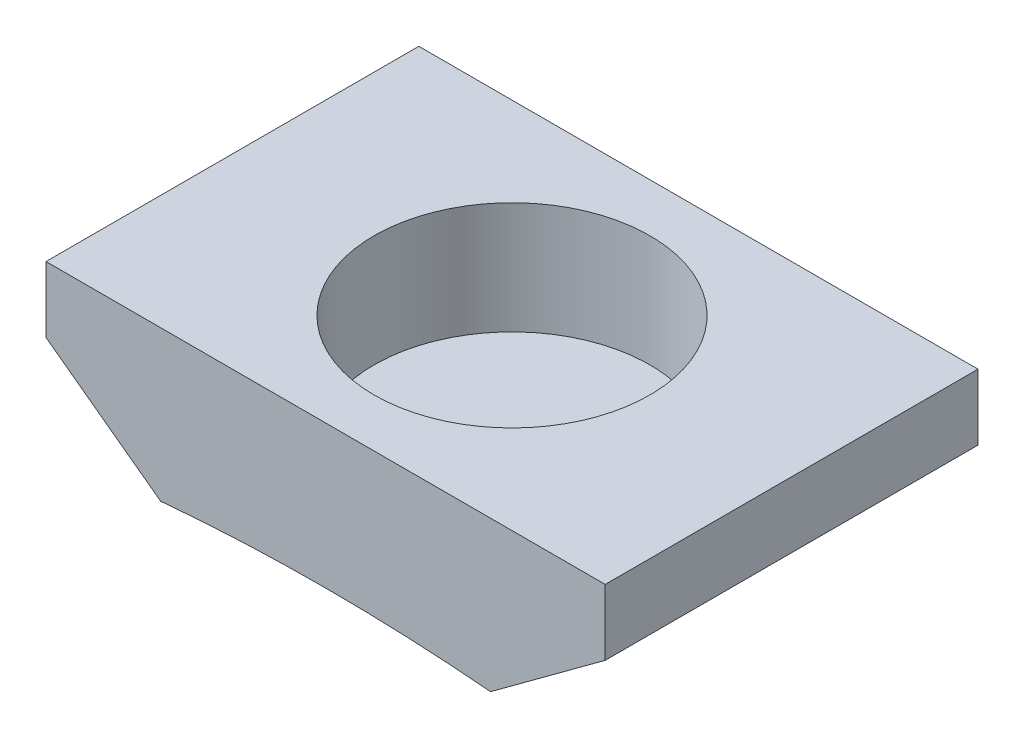
ISO-10303-21;
HEADER;
FILE_DESCRIPTION(('STEP AP214'),'2;1');
FILE_NAME('part.step','',(''),(''),'','','');
FILE_SCHEMA(('AUTOMOTIVE_DESIGN { 1 0 10303 214 1 1 1 1 }'));
ENDSEC;
DATA;
#1=APPLICATION_CONTEXT('core data for automotive mechanical design processes');
#2=APPLICATION_PROTOCOL_DEFINITION('international standard','automotive_design',2000,#1);
#3=PRODUCT_CONTEXT('',#1,'mechanical');
#4=PRODUCT('Part','Part','',(#3));
#5=PRODUCT_RELATED_PRODUCT_CATEGORY('part','',(#4));
#6=PRODUCT_DEFINITION_FORMATION('','',#4);
#7=PRODUCT_DEFINITION_CONTEXT('part definition',#1,'design');
#8=PRODUCT_DEFINITION('design','',#6,#7);
#9=PRODUCT_DEFINITION_SHAPE('','',#8);
#10=(LENGTH_UNIT() NAMED_UNIT(*) SI_UNIT(.MILLI.,.METRE.));
#11=(NAMED_UNIT(*) PLANE_ANGLE_UNIT() SI_UNIT($,.RADIAN.));
#12=(NAMED_UNIT(*) SI_UNIT($,.STERADIAN.) SOLID_ANGLE_UNIT());
#13=UNCERTAINTY_MEASURE_WITH_UNIT(LENGTH_MEASURE(1.E-05),#10,'distance_accuracy_value','');
#14=(GEOMETRIC_REPRESENTATION_CONTEXT(3) GLOBAL_UNCERTAINTY_ASSIGNED_CONTEXT((#13)) GLOBAL_UNIT_ASSIGNED_CONTEXT((#10,
#11,#12)) REPRESENTATION_CONTEXT('',''));
#15=CARTESIAN_POINT('',(0.,0.,0.));
#16=DIRECTION('',(0.,0.,1.));
#17=DIRECTION('',(1.,0.,0.));
#18=AXIS2_PLACEMENT_3D('',#15,#16,#17);
#19=CARTESIAN_POINT('',(-7.5,1.4,5.));
#20=DIRECTION('',(1.,0.,0.));
#21=DIRECTION('',(0.,0.,-1.));
#22=AXIS2_PLACEMENT_3D('',#19,#20,#21);
#23=PLANE('',#22);
#24=DIRECTION('',(0.,-1.,0.));
#25=VECTOR('',#24,1.);
#26=CARTESIAN_POINT('',(-7.5,1.4,-5.));
#27=LINE('',#26,#25);
#28=CARTESIAN_POINT('',(-7.5,4.4,-5.));
#29=VERTEX_POINT('',#28);
#30=CARTESIAN_POINT('',(-7.5,2.63461569632752,-5.));
#31=VERTEX_POINT('',#30);
#32=EDGE_CURVE('E122',#29,#31,#27,.T.);
#33=ORIENTED_EDGE('',*,*,#32,.T.);
#34=DIRECTION('',(0.,0.,1.));
#35=VECTOR('',#34,1.);
#36=CARTESIAN_POINT('',(-7.5,2.63461569632752,5.));
#37=LINE('',#36,#35);
#38=CARTESIAN_POINT('',(-7.5,2.63461569632752,5.));
#39=VERTEX_POINT('',#38);
#40=EDGE_CURVE('E11',#31,#39,#37,.T.);
#41=ORIENTED_EDGE('',*,*,#40,.T.);
#42=DIRECTION('',(0.,-1.,0.));
#43=VECTOR('',#42,1.);
#44=CARTESIAN_POINT('',(-7.5,1.4,5.));
#45=LINE('',#44,#43);
#46=CARTESIAN_POINT('',(-7.5,4.4,5.));
#47=VERTEX_POINT('',#46);
#48=EDGE_CURVE('E90',#47,#39,#45,.T.);
#49=ORIENTED_EDGE('',*,*,#48,.F.);
#50=DIRECTION('',(0.,0.,1.));
#51=VECTOR('',#50,1.);
#52=CARTESIAN_POINT('',(-7.5,4.4,5.));
#53=LINE('',#52,#51);
#54=EDGE_CURVE('E94',#29,#47,#53,.T.);
#55=ORIENTED_EDGE('',*,*,#54,.F.);
#56=EDGE_LOOP('',(#33,#41,#49,#55));
#57=FACE_BOUND('',#56,.T.);
#58=ADVANCED_FACE('F35',(#57),#23,.F.);
#59=CARTESIAN_POINT('',(7.5,1.4,5.));
#60=DIRECTION('',(0.,0.,-1.));
#61=DIRECTION('',(-1.,0.,0.));
#62=AXIS2_PLACEMENT_3D('',#59,#60,#61);
#63=PLANE('',#62);
#64=CARTESIAN_POINT('',(0.,-49.434299833213,5.));
#65=DIRECTION('',(0.,0.,-1.));
#66=DIRECTION('',(-1.,0.,0.));
#67=AXIS2_PLACEMENT_3D('',#64,#65,#66);
#68=CIRCLE('',#67,50.);
#69=CARTESIAN_POINT('',(-4.42469587988262,0.369536026794327,5.));
#70=VERTEX_POINT('',#69);
#71=CARTESIAN_POINT('',(4.42469587988261,0.369536026794334,5.));
#72=VERTEX_POINT('',#71);
#73=EDGE_CURVE('E116',#70,#72,#68,.T.);
#74=ORIENTED_EDGE('',*,*,#73,.T.);
#75=DIRECTION('',(-0.805172589883462,-0.593040555527494,0.));
#76=VECTOR('',#75,1.);
#77=CARTESIAN_POINT('',(7.5,2.63461569632752,5.));
#78=LINE('',#77,#76);
#79=CARTESIAN_POINT('',(7.5,2.63461569632752,5.));
#80=VERTEX_POINT('',#79);
#81=EDGE_CURVE('E43',#72,#80,#78,.F.);
#82=ORIENTED_EDGE('',*,*,#81,.T.);
#83=DIRECTION('',(0.,-1.,0.));
#84=VECTOR('',#83,1.);
#85=CARTESIAN_POINT('',(7.5,1.4,5.));
#86=LINE('',#85,#84);
#87=CARTESIAN_POINT('',(7.5,4.4,5.));
#88=VERTEX_POINT('',#87);
#89=EDGE_CURVE('E97',#88,#80,#86,.T.);
#90=ORIENTED_EDGE('',*,*,#89,.F.);
#91=DIRECTION('',(1.,0.,0.));
#92=VECTOR('',#91,1.);
#93=CARTESIAN_POINT('',(7.5,4.4,5.));
#94=LINE('',#93,#92);
#95=EDGE_CURVE('E100',#47,#88,#94,.T.);
#96=ORIENTED_EDGE('',*,*,#95,.F.);
#97=ORIENTED_EDGE('',*,*,#48,.T.);
#98=DIRECTION('',(0.80517258988346,-0.593040555527496,0.));
#99=VECTOR('',#98,1.);
#100=CARTESIAN_POINT('',(-7.5,2.63461569632752,5.));
#101=LINE('',#100,#99);
#102=EDGE_CURVE('E50',#39,#70,#101,.T.);
#103=ORIENTED_EDGE('',*,*,#102,.T.);
#104=EDGE_LOOP('',(#74,#82,#90,#96,#97,#103));
#105=FACE_BOUND('',#104,.T.);
#106=ADVANCED_FACE('F101',(#105),#63,.F.);
#107=CARTESIAN_POINT('',(7.5,1.4,5.));
#108=DIRECTION('',(-1.,0.,0.));
#109=DIRECTION('',(0.,0.,1.));
#110=AXIS2_PLACEMENT_3D('',#107,#108,#109);
#111=PLANE('',#110);
#112=ORIENTED_EDGE('',*,*,#89,.T.);
#113=DIRECTION('',(0.,0.,-1.));
#114=VECTOR('',#113,1.);
#115=CARTESIAN_POINT('',(7.5,2.63461569632752,5.));
#116=LINE('',#115,#114);
#117=CARTESIAN_POINT('',(7.5,2.63461569632752,-5.));
#118=VERTEX_POINT('',#117);
#119=EDGE_CURVE('E130',#80,#118,#116,.T.);
#120=ORIENTED_EDGE('',*,*,#119,.T.);
#121=DIRECTION('',(0.,-1.,0.));
#122=VECTOR('',#121,1.);
#123=CARTESIAN_POINT('',(7.5,1.4,-5.));
#124=LINE('',#123,#122);
#125=CARTESIAN_POINT('',(7.5,4.4,-5.));
#126=VERTEX_POINT('',#125);
#127=EDGE_CURVE('E124',#126,#118,#124,.T.);
#128=ORIENTED_EDGE('',*,*,#127,.F.);
#129=DIRECTION('',(0.,0.,-1.));
#130=VECTOR('',#129,1.);
#131=CARTESIAN_POINT('',(7.5,4.4,5.));
#132=LINE('',#131,#130);
#133=EDGE_CURVE('E106',#88,#126,#132,.T.);
#134=ORIENTED_EDGE('',*,*,#133,.F.);
#135=EDGE_LOOP('',(#112,#120,#128,#134));
#136=FACE_BOUND('',#135,.T.);
#137=ADVANCED_FACE('F144',(#136),#111,.F.);
#138=CARTESIAN_POINT('',(7.5,1.4,-5.));
#139=DIRECTION('',(0.,0.,1.));
#140=DIRECTION('',(1.,0.,0.));
#141=AXIS2_PLACEMENT_3D('',#138,#139,#140);
#142=PLANE('',#141);
#143=ORIENTED_EDGE('',*,*,#127,.T.);
#144=DIRECTION('',(0.805172589883462,0.593040555527494,0.));
#145=VECTOR('',#144,1.);
#146=CARTESIAN_POINT('',(7.5,2.63461569632752,-5.));
#147=LINE('',#146,#145);
#148=CARTESIAN_POINT('',(4.42469587988261,0.369536026794334,-5.));
#149=VERTEX_POINT('',#148);
#150=EDGE_CURVE('E135',#118,#149,#147,.F.);
#151=ORIENTED_EDGE('',*,*,#150,.T.);
#152=CARTESIAN_POINT('',(0.,-49.434299833213,-5.));
#153=DIRECTION('',(0.,0.,-1.));
#154=DIRECTION('',(-1.,0.,0.));
#155=AXIS2_PLACEMENT_3D('',#152,#153,#154);
#156=CIRCLE('',#155,50.);
#157=CARTESIAN_POINT('',(-4.42469587988262,0.369536026794327,-5.));
#158=VERTEX_POINT('',#157);
#159=EDGE_CURVE('E149',#158,#149,#156,.T.);
#160=ORIENTED_EDGE('',*,*,#159,.F.);
#161=DIRECTION('',(-0.80517258988346,0.593040555527496,0.));
#162=VECTOR('',#161,1.);
#163=CARTESIAN_POINT('',(-7.5,2.63461569632752,-5.));
#164=LINE('',#163,#162);
#165=EDGE_CURVE('E133',#158,#31,#164,.T.);
#166=ORIENTED_EDGE('',*,*,#165,.T.);
#167=ORIENTED_EDGE('',*,*,#32,.F.);
#168=DIRECTION('',(-1.,0.,0.));
#169=VECTOR('',#168,1.);
#170=CARTESIAN_POINT('',(7.5,4.4,-5.));
#171=LINE('',#170,#169);
#172=EDGE_CURVE('E112',#126,#29,#171,.T.);
#173=ORIENTED_EDGE('',*,*,#172,.F.);
#174=EDGE_LOOP('',(#143,#151,#160,#166,#167,#173));
#175=FACE_BOUND('',#174,.T.);
#176=ADVANCED_FACE('F148',(#175),#142,.F.);
#177=CARTESIAN_POINT('',(0.,4.4,0.));
#178=DIRECTION('',(0.,1.,0.));
#179=DIRECTION('',(0.,0.,1.));
#180=AXIS2_PLACEMENT_3D('',#177,#178,#179);
#181=PLANE('',#180);
#182=ORIENTED_EDGE('',*,*,#54,.T.);
#183=ORIENTED_EDGE('',*,*,#95,.T.);
#184=ORIENTED_EDGE('',*,*,#133,.T.);
#185=ORIENTED_EDGE('',*,*,#172,.T.);
#186=EDGE_LOOP('',(#182,#183,#184,#185));
#187=FACE_BOUND('',#186,.T.);
#188=CARTESIAN_POINT('',(0.,4.4,0.));
#189=DIRECTION('',(0.,1.,0.));
#190=DIRECTION('',(0.,0.,1.));
#191=AXIS2_PLACEMENT_3D('',#188,#189,#190);
#192=CIRCLE('',#191,3.7);
#193=CARTESIAN_POINT('',(0.,4.4,3.7));
#194=VERTEX_POINT('',#193);
#195=EDGE_CURVE('E113',#194,#194,#192,.T.);
#196=ORIENTED_EDGE('',*,*,#195,.F.);
#197=EDGE_LOOP('',(#196));
#198=FACE_BOUND('',#197,.T.);
#199=ADVANCED_FACE('F109',(#187,#198),#181,.T.);
#200=CARTESIAN_POINT('',(0.,4.4,0.));
#201=DIRECTION('',(0.,-1.,0.));
#202=DIRECTION('',(0.,0.,-1.));
#203=AXIS2_PLACEMENT_3D('',#200,#201,#202);
#204=CYLINDRICAL_SURFACE('',#203,3.7);
#205=ORIENTED_EDGE('',*,*,#195,.T.);
#206=EDGE_LOOP('',(#205));
#207=FACE_BOUND('',#206,.T.);
#208=CARTESIAN_POINT('',(0.,1.4,0.));
#209=DIRECTION('',(0.,1.,0.));
#210=DIRECTION('',(0.,0.,1.));
#211=AXIS2_PLACEMENT_3D('',#208,#209,#210);
#212=CIRCLE('',#211,3.7);
#213=CARTESIAN_POINT('',(0.,1.4,3.7));
#214=VERTEX_POINT('',#213);
#215=EDGE_CURVE('E96',#214,#214,#212,.F.);
#216=ORIENTED_EDGE('',*,*,#215,.T.);
#217=EDGE_LOOP('',(#216));
#218=FACE_BOUND('',#217,.T.);
#219=ADVANCED_FACE('F172',(#207,#218),#204,.F.);
#220=CARTESIAN_POINT('',(0.,1.4,0.));
#221=DIRECTION('',(0.,1.,0.));
#222=DIRECTION('',(0.,0.,1.));
#223=AXIS2_PLACEMENT_3D('',#220,#221,#222);
#224=PLANE('',#223);
#225=ORIENTED_EDGE('',*,*,#215,.F.);
#226=EDGE_LOOP('',(#225));
#227=FACE_BOUND('',#226,.T.);
#228=ADVANCED_FACE('F169',(#227),#224,.T.);
#229=CARTESIAN_POINT('',(0.,-49.434299833213,5.));
#230=DIRECTION('',(0.,0.,-1.));
#231=DIRECTION('',(-1.,0.,0.));
#232=AXIS2_PLACEMENT_3D('',#229,#230,#231);
#233=CYLINDRICAL_SURFACE('',#232,50.);
#234=ORIENTED_EDGE('',*,*,#159,.T.);
#235=DIRECTION('',(0.,0.,-1.));
#236=VECTOR('',#235,1.);
#237=CARTESIAN_POINT('',(4.42469587988261,0.369536026794334,5.));
#238=LINE('',#237,#236);
#239=EDGE_CURVE('E57',#149,#72,#238,.F.);
#240=ORIENTED_EDGE('',*,*,#239,.T.);
#241=ORIENTED_EDGE('',*,*,#73,.F.);
#242=DIRECTION('',(0.,0.,-1.));
#243=VECTOR('',#242,1.);
#244=CARTESIAN_POINT('',(-4.42469587988263,0.369536026794334,5.));
#245=LINE('',#244,#243);
#246=EDGE_CURVE('E137',#70,#158,#245,.T.);
#247=ORIENTED_EDGE('',*,*,#246,.T.);
#248=EDGE_LOOP('',(#234,#240,#241,#247));
#249=FACE_BOUND('',#248,.T.);
#250=ADVANCED_FACE('F151',(#249),#233,.F.);
#251=CARTESIAN_POINT('',(7.5,2.63461569632752,5.));
#252=DIRECTION('',(-0.593040555527494,0.805172589883462,0.));
#253=DIRECTION('',(0.,0.,-1.));
#254=AXIS2_PLACEMENT_3D('',#251,#252,#253);
#255=PLANE('',#254);
#256=ORIENTED_EDGE('',*,*,#81,.F.);
#257=ORIENTED_EDGE('',*,*,#239,.F.);
#258=ORIENTED_EDGE('',*,*,#150,.F.);
#259=ORIENTED_EDGE('',*,*,#119,.F.);
#260=EDGE_LOOP('',(#256,#257,#258,#259));
#261=FACE_BOUND('',#260,.T.);
#262=ADVANCED_FACE('F145',(#261),#255,.F.);
#263=CARTESIAN_POINT('',(-7.5,2.63461569632752,5.));
#264=DIRECTION('',(-0.593040555527496,-0.80517258988346,0.));
#265=DIRECTION('',(0.,0.,-1.));
#266=AXIS2_PLACEMENT_3D('',#263,#264,#265);
#267=PLANE('',#266);
#268=ORIENTED_EDGE('',*,*,#165,.F.);
#269=ORIENTED_EDGE('',*,*,#246,.F.);
#270=ORIENTED_EDGE('',*,*,#102,.F.);
#271=ORIENTED_EDGE('',*,*,#40,.F.);
#272=EDGE_LOOP('',(#268,#269,#270,#271));
#273=FACE_BOUND('',#272,.T.);
#274=ADVANCED_FACE('F37',(#273),#267,.T.);
#275=CLOSED_SHELL('',(#58,#106,#137,#176,#199,#219,#228,#250,#262,#274));
#276=MANIFOLD_SOLID_BREP('B2',#275);
#277=ADVANCED_BREP_SHAPE_REPRESENTATION('',(#18,#276),#14);
#278=SHAPE_DEFINITION_REPRESENTATION(#9,#277);
ENDSEC;
END-ISO-10303-21;
